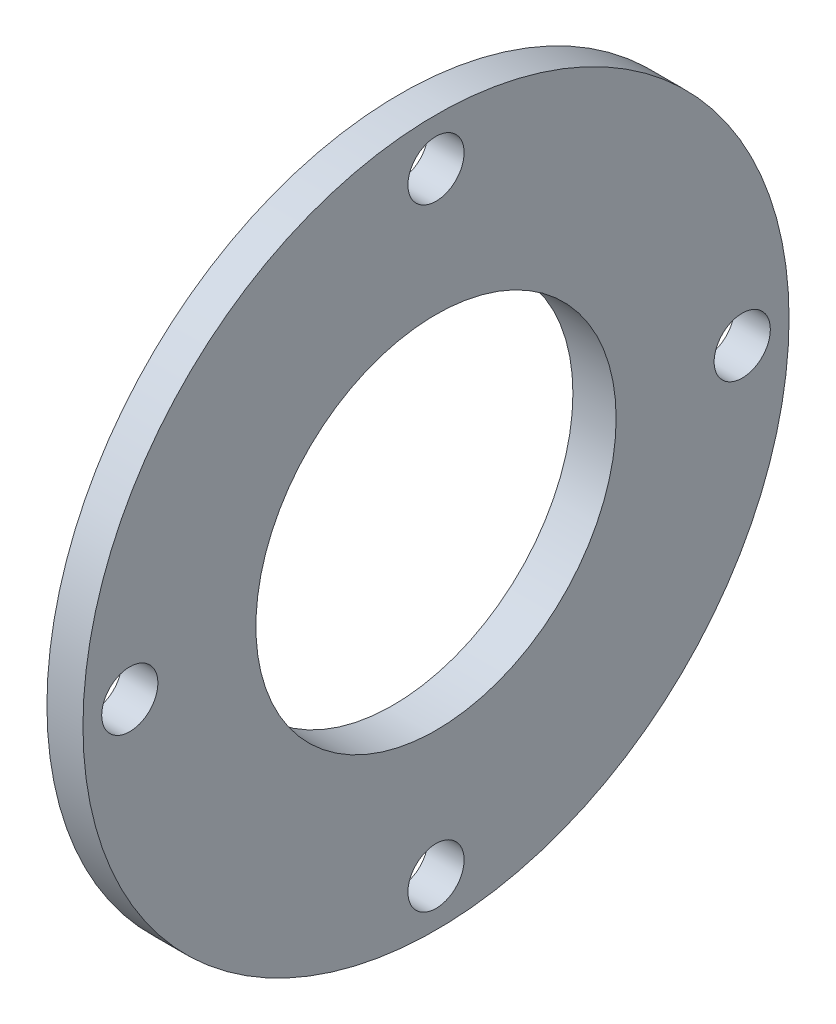
ISO-10303-21;
HEADER;
FILE_DESCRIPTION(('STEP AP214'),'2;1');
FILE_NAME('part.step','',(''),(''),'','','');
FILE_SCHEMA(('AUTOMOTIVE_DESIGN { 1 0 10303 214 1 1 1 1 }'));
ENDSEC;
DATA;
#1=APPLICATION_CONTEXT('core data for automotive mechanical design processes');
#2=APPLICATION_PROTOCOL_DEFINITION('international standard','automotive_design',2000,#1);
#3=PRODUCT_CONTEXT('',#1,'mechanical');
#4=PRODUCT('Part','Part','',(#3));
#5=PRODUCT_RELATED_PRODUCT_CATEGORY('part','',(#4));
#6=PRODUCT_DEFINITION_FORMATION('','',#4);
#7=PRODUCT_DEFINITION_CONTEXT('part definition',#1,'design');
#8=PRODUCT_DEFINITION('design','',#6,#7);
#9=PRODUCT_DEFINITION_SHAPE('','',#8);
#10=(LENGTH_UNIT() NAMED_UNIT(*) SI_UNIT(.MILLI.,.METRE.));
#11=(NAMED_UNIT(*) PLANE_ANGLE_UNIT() SI_UNIT($,.RADIAN.));
#12=(NAMED_UNIT(*) SI_UNIT($,.STERADIAN.) SOLID_ANGLE_UNIT());
#13=UNCERTAINTY_MEASURE_WITH_UNIT(LENGTH_MEASURE(1.E-05),#10,'distance_accuracy_value','');
#14=(GEOMETRIC_REPRESENTATION_CONTEXT(3) GLOBAL_UNCERTAINTY_ASSIGNED_CONTEXT((#13)) GLOBAL_UNIT_ASSIGNED_CONTEXT((#10,
#11,#12)) REPRESENTATION_CONTEXT('',''));
#15=CARTESIAN_POINT('',(0.,0.,0.));
#16=DIRECTION('',(0.,0.,1.));
#17=DIRECTION('',(1.,0.,0.));
#18=AXIS2_PLACEMENT_3D('',#15,#16,#17);
#19=CARTESIAN_POINT('',(0.,0.,0.));
#20=DIRECTION('',(1.,0.,0.));
#21=DIRECTION('',(0.,0.,-1.));
#22=AXIS2_PLACEMENT_3D('',#19,#20,#21);
#23=CYLINDRICAL_SURFACE('',#22,31.);
#24=CARTESIAN_POINT('',(2.,0.,0.));
#25=DIRECTION('',(1.,0.,0.));
#26=DIRECTION('',(0.,0.,-1.));
#27=AXIS2_PLACEMENT_3D('',#24,#25,#26);
#28=CIRCLE('',#27,31.);
#29=CARTESIAN_POINT('',(2.,0.,-31.));
#30=VERTEX_POINT('',#29);
#31=EDGE_CURVE('E50',#30,#30,#28,.T.);
#32=ORIENTED_EDGE('',*,*,#31,.T.);
#33=EDGE_LOOP('',(#32));
#34=FACE_BOUND('',#33,.T.);
#35=CARTESIAN_POINT('',(0.,0.,0.));
#36=DIRECTION('',(1.,0.,0.));
#37=DIRECTION('',(0.,0.,-1.));
#38=AXIS2_PLACEMENT_3D('',#35,#36,#37);
#39=CIRCLE('',#38,31.);
#40=CARTESIAN_POINT('',(0.,0.,-31.));
#41=VERTEX_POINT('',#40);
#42=EDGE_CURVE('E10',#41,#41,#39,.T.);
#43=ORIENTED_EDGE('',*,*,#42,.F.);
#44=EDGE_LOOP('',(#43));
#45=FACE_BOUND('',#44,.T.);
#46=ADVANCED_FACE('F31',(#34,#45),#23,.F.);
#47=CARTESIAN_POINT('',(0.,31.,0.));
#48=DIRECTION('',(-1.,0.,0.));
#49=DIRECTION('',(0.,0.,1.));
#50=AXIS2_PLACEMENT_3D('',#47,#48,#49);
#51=PLANE('',#50);
#52=ORIENTED_EDGE('',*,*,#42,.T.);
#53=EDGE_LOOP('',(#52));
#54=FACE_BOUND('',#53,.T.);
#55=CARTESIAN_POINT('',(0.,0.,0.));
#56=DIRECTION('',(1.,0.,0.));
#57=DIRECTION('',(0.,0.,-1.));
#58=AXIS2_PLACEMENT_3D('',#55,#56,#57);
#59=CIRCLE('',#58,36.);
#60=CARTESIAN_POINT('',(0.,0.,-36.));
#61=VERTEX_POINT('',#60);
#62=EDGE_CURVE('E38',#61,#61,#59,.T.);
#63=ORIENTED_EDGE('',*,*,#62,.F.);
#64=EDGE_LOOP('',(#63));
#65=FACE_BOUND('',#64,.T.);
#66=ADVANCED_FACE('F91',(#54,#65),#51,.T.);
#67=CARTESIAN_POINT('',(0.,0.,0.));
#68=DIRECTION('',(1.,0.,0.));
#69=DIRECTION('',(0.,0.,-1.));
#70=AXIS2_PLACEMENT_3D('',#67,#68,#69);
#71=CYLINDRICAL_SURFACE('',#70,36.);
#72=ORIENTED_EDGE('',*,*,#62,.T.);
#73=EDGE_LOOP('',(#72));
#74=FACE_BOUND('',#73,.T.);
#75=CARTESIAN_POINT('',(2.99999999999999,0.,0.));
#76=DIRECTION('',(1.,0.,0.));
#77=DIRECTION('',(0.,0.,-1.));
#78=AXIS2_PLACEMENT_3D('',#75,#76,#77);
#79=CIRCLE('',#78,36.);
#80=CARTESIAN_POINT('',(2.99999999999999,0.,-36.));
#81=VERTEX_POINT('',#80);
#82=EDGE_CURVE('E43',#81,#81,#79,.T.);
#83=ORIENTED_EDGE('',*,*,#82,.F.);
#84=EDGE_LOOP('',(#83));
#85=FACE_BOUND('',#84,.T.);
#86=ADVANCED_FACE('F89',(#74,#85),#71,.T.);
#87=CARTESIAN_POINT('',(2.99999999999999,36.,0.));
#88=DIRECTION('',(-1.,0.,0.));
#89=DIRECTION('',(0.,0.,1.));
#90=AXIS2_PLACEMENT_3D('',#87,#88,#89);
#91=PLANE('',#90);
#92=CARTESIAN_POINT('',(2.99999999999999,42.5,-1.48387956900833E-13));
#93=DIRECTION('',(-1.,0.,0.));
#94=DIRECTION('',(0.,1.,0.));
#95=AXIS2_PLACEMENT_3D('',#92,#93,#94);
#96=CIRCLE('',#95,3.9);
#97=CARTESIAN_POINT('',(2.99999999999999,46.4,-1.62004734122321E-13));
#98=VERTEX_POINT('',#97);
#99=EDGE_CURVE('E55',#98,#98,#96,.T.);
#100=ORIENTED_EDGE('',*,*,#99,.F.);
#101=EDGE_LOOP('',(#100));
#102=FACE_BOUND('',#101,.T.);
#103=CARTESIAN_POINT('',(2.99999999999999,0.,-42.5));
#104=DIRECTION('',(-1.,0.,0.));
#105=DIRECTION('',(0.,0.,-1.));
#106=AXIS2_PLACEMENT_3D('',#103,#104,#105);
#107=CIRCLE('',#106,3.9);
#108=CARTESIAN_POINT('',(2.99999999999999,0.,-46.4));
#109=VERTEX_POINT('',#108);
#110=EDGE_CURVE('E216',#109,#109,#107,.T.);
#111=ORIENTED_EDGE('',*,*,#110,.F.);
#112=EDGE_LOOP('',(#111));
#113=FACE_BOUND('',#112,.T.);
#114=CARTESIAN_POINT('',(2.99999999999999,-42.5,4.451638707025E-13));
#115=DIRECTION('',(-1.,0.,0.));
#116=DIRECTION('',(0.,-1.,0.));
#117=AXIS2_PLACEMENT_3D('',#114,#115,#116);
#118=CIRCLE('',#117,3.9);
#119=CARTESIAN_POINT('',(2.99999999999999,-46.4,4.86014202366964E-13));
#120=VERTEX_POINT('',#119);
#121=EDGE_CURVE('E68',#120,#120,#118,.T.);
#122=ORIENTED_EDGE('',*,*,#121,.F.);
#123=EDGE_LOOP('',(#122));
#124=FACE_BOUND('',#123,.T.);
#125=CARTESIAN_POINT('',(2.99999999999999,0.,42.5));
#126=DIRECTION('',(-1.,0.,0.));
#127=DIRECTION('',(0.,0.,1.));
#128=AXIS2_PLACEMENT_3D('',#125,#126,#127);
#129=CIRCLE('',#128,3.9);
#130=CARTESIAN_POINT('',(2.99999999999999,0.,46.4));
#131=VERTEX_POINT('',#130);
#132=EDGE_CURVE('E51',#131,#131,#129,.T.);
#133=ORIENTED_EDGE('',*,*,#132,.F.);
#134=EDGE_LOOP('',(#133));
#135=FACE_BOUND('',#134,.T.);
#136=ORIENTED_EDGE('',*,*,#82,.T.);
#137=EDGE_LOOP('',(#136));
#138=FACE_BOUND('',#137,.T.);
#139=CARTESIAN_POINT('',(2.99999999999999,0.,0.));
#140=DIRECTION('',(1.,0.,0.));
#141=DIRECTION('',(0.,0.,-1.));
#142=AXIS2_PLACEMENT_3D('',#139,#140,#141);
#143=CIRCLE('',#142,49.);
#144=CARTESIAN_POINT('',(2.99999999999999,0.,-49.));
#145=VERTEX_POINT('',#144);
#146=EDGE_CURVE('E81',#145,#145,#143,.T.);
#147=ORIENTED_EDGE('',*,*,#146,.F.);
#148=EDGE_LOOP('',(#147));
#149=FACE_BOUND('',#148,.T.);
#150=ADVANCED_FACE('F86',(#102,#113,#124,#135,#138,#149),#91,.T.);
#151=CARTESIAN_POINT('',(0.,0.,0.));
#152=DIRECTION('',(1.,0.,0.));
#153=DIRECTION('',(0.,0.,-1.));
#154=AXIS2_PLACEMENT_3D('',#151,#152,#153);
#155=CYLINDRICAL_SURFACE('',#154,49.);
#156=ORIENTED_EDGE('',*,*,#146,.T.);
#157=EDGE_LOOP('',(#156));
#158=FACE_BOUND('',#157,.T.);
#159=CARTESIAN_POINT('',(8.,0.,0.));
#160=DIRECTION('',(1.,0.,0.));
#161=DIRECTION('',(0.,0.,-1.));
#162=AXIS2_PLACEMENT_3D('',#159,#160,#161);
#163=CIRCLE('',#162,49.);
#164=CARTESIAN_POINT('',(8.,0.,-49.));
#165=VERTEX_POINT('',#164);
#166=EDGE_CURVE('E78',#165,#165,#163,.T.);
#167=ORIENTED_EDGE('',*,*,#166,.F.);
#168=EDGE_LOOP('',(#167));
#169=FACE_BOUND('',#168,.T.);
#170=ADVANCED_FACE('F98',(#158,#169),#155,.T.);
#171=CARTESIAN_POINT('',(8.,49.,0.));
#172=DIRECTION('',(1.,0.,0.));
#173=DIRECTION('',(0.,0.,-1.));
#174=AXIS2_PLACEMENT_3D('',#171,#172,#173);
#175=PLANE('',#174);
#176=CARTESIAN_POINT('',(8.,42.5,-1.48387956900833E-13));
#177=DIRECTION('',(1.,0.,0.));
#178=DIRECTION('',(0.,0.,-1.));
#179=AXIS2_PLACEMENT_3D('',#176,#177,#178);
#180=CIRCLE('',#179,3.9);
#181=CARTESIAN_POINT('',(8.,42.5,-3.90000000000015));
#182=VERTEX_POINT('',#181);
#183=EDGE_CURVE('E34',#182,#182,#180,.T.);
#184=ORIENTED_EDGE('',*,*,#183,.F.);
#185=EDGE_LOOP('',(#184));
#186=FACE_BOUND('',#185,.T.);
#187=CARTESIAN_POINT('',(8.,0.,-42.5));
#188=DIRECTION('',(1.,0.,0.));
#189=DIRECTION('',(0.,0.,-1.));
#190=AXIS2_PLACEMENT_3D('',#187,#188,#189);
#191=CIRCLE('',#190,3.9);
#192=CARTESIAN_POINT('',(8.,0.,-46.4));
#193=VERTEX_POINT('',#192);
#194=EDGE_CURVE('E54',#193,#193,#191,.T.);
#195=ORIENTED_EDGE('',*,*,#194,.F.);
#196=EDGE_LOOP('',(#195));
#197=FACE_BOUND('',#196,.T.);
#198=CARTESIAN_POINT('',(8.,-42.5,4.451638707025E-13));
#199=DIRECTION('',(1.,0.,0.));
#200=DIRECTION('',(0.,0.,-1.));
#201=AXIS2_PLACEMENT_3D('',#198,#199,#200);
#202=CIRCLE('',#201,3.9);
#203=CARTESIAN_POINT('',(8.,-42.5,-3.89999999999955));
#204=VERTEX_POINT('',#203);
#205=EDGE_CURVE('E52',#204,#204,#202,.T.);
#206=ORIENTED_EDGE('',*,*,#205,.F.);
#207=EDGE_LOOP('',(#206));
#208=FACE_BOUND('',#207,.T.);
#209=CARTESIAN_POINT('',(8.,0.,42.5));
#210=DIRECTION('',(1.,0.,0.));
#211=DIRECTION('',(0.,0.,-1.));
#212=AXIS2_PLACEMENT_3D('',#209,#210,#211);
#213=CIRCLE('',#212,3.9);
#214=CARTESIAN_POINT('',(8.,0.,38.6));
#215=VERTEX_POINT('',#214);
#216=EDGE_CURVE('E47',#215,#215,#213,.T.);
#217=ORIENTED_EDGE('',*,*,#216,.F.);
#218=EDGE_LOOP('',(#217));
#219=FACE_BOUND('',#218,.T.);
#220=ORIENTED_EDGE('',*,*,#166,.T.);
#221=EDGE_LOOP('',(#220));
#222=FACE_BOUND('',#221,.T.);
#223=CARTESIAN_POINT('',(8.,0.,0.));
#224=DIRECTION('',(1.,0.,0.));
#225=DIRECTION('',(0.,0.,-1.));
#226=AXIS2_PLACEMENT_3D('',#223,#224,#225);
#227=CIRCLE('',#226,25.);
#228=CARTESIAN_POINT('',(8.,0.,-25.));
#229=VERTEX_POINT('',#228);
#230=EDGE_CURVE('E75',#229,#229,#227,.T.);
#231=ORIENTED_EDGE('',*,*,#230,.F.);
#232=EDGE_LOOP('',(#231));
#233=FACE_BOUND('',#232,.T.);
#234=ADVANCED_FACE('F121',(#186,#197,#208,#219,#222,#233),#175,.T.);
#235=CARTESIAN_POINT('',(0.,0.,0.));
#236=DIRECTION('',(1.,0.,0.));
#237=DIRECTION('',(0.,0.,-1.));
#238=AXIS2_PLACEMENT_3D('',#235,#236,#237);
#239=CYLINDRICAL_SURFACE('',#238,25.);
#240=ORIENTED_EDGE('',*,*,#230,.T.);
#241=EDGE_LOOP('',(#240));
#242=FACE_BOUND('',#241,.T.);
#243=CARTESIAN_POINT('',(2.,0.,0.));
#244=DIRECTION('',(1.,0.,0.));
#245=DIRECTION('',(0.,0.,-1.));
#246=AXIS2_PLACEMENT_3D('',#243,#244,#245);
#247=CIRCLE('',#246,25.);
#248=CARTESIAN_POINT('',(2.,0.,-25.));
#249=VERTEX_POINT('',#248);
#250=EDGE_CURVE('E72',#249,#249,#247,.T.);
#251=ORIENTED_EDGE('',*,*,#250,.F.);
#252=EDGE_LOOP('',(#251));
#253=FACE_BOUND('',#252,.T.);
#254=ADVANCED_FACE('F111',(#242,#253),#239,.F.);
#255=CARTESIAN_POINT('',(2.,25.,0.));
#256=DIRECTION('',(-1.,0.,0.));
#257=DIRECTION('',(0.,0.,1.));
#258=AXIS2_PLACEMENT_3D('',#255,#256,#257);
#259=PLANE('',#258);
#260=ORIENTED_EDGE('',*,*,#250,.T.);
#261=EDGE_LOOP('',(#260));
#262=FACE_BOUND('',#261,.T.);
#263=ORIENTED_EDGE('',*,*,#31,.F.);
#264=EDGE_LOOP('',(#263));
#265=FACE_BOUND('',#264,.T.);
#266=ADVANCED_FACE('F108',(#262,#265),#259,.T.);
#267=CARTESIAN_POINT('',(13.,0.,42.5));
#268=DIRECTION('',(-1.,0.,0.));
#269=DIRECTION('',(0.,0.,1.));
#270=AXIS2_PLACEMENT_3D('',#267,#268,#269);
#271=CYLINDRICAL_SURFACE('',#270,3.9);
#272=ORIENTED_EDGE('',*,*,#216,.T.);
#273=EDGE_LOOP('',(#272));
#274=FACE_BOUND('',#273,.T.);
#275=ORIENTED_EDGE('',*,*,#132,.T.);
#276=EDGE_LOOP('',(#275));
#277=FACE_BOUND('',#276,.T.);
#278=ADVANCED_FACE('F110',(#274,#277),#271,.F.);
#279=CARTESIAN_POINT('',(13.,-42.5,4.451638707025E-13));
#280=DIRECTION('',(-1.,0.,0.));
#281=DIRECTION('',(0.,0.,1.));
#282=AXIS2_PLACEMENT_3D('',#279,#280,#281);
#283=CYLINDRICAL_SURFACE('',#282,3.9);
#284=ORIENTED_EDGE('',*,*,#205,.T.);
#285=EDGE_LOOP('',(#284));
#286=FACE_BOUND('',#285,.T.);
#287=ORIENTED_EDGE('',*,*,#121,.T.);
#288=EDGE_LOOP('',(#287));
#289=FACE_BOUND('',#288,.T.);
#290=ADVANCED_FACE('F118',(#286,#289),#283,.F.);
#291=CARTESIAN_POINT('',(13.,0.,-42.5));
#292=DIRECTION('',(-1.,0.,0.));
#293=DIRECTION('',(0.,0.,1.));
#294=AXIS2_PLACEMENT_3D('',#291,#292,#293);
#295=CYLINDRICAL_SURFACE('',#294,3.9);
#296=ORIENTED_EDGE('',*,*,#194,.T.);
#297=EDGE_LOOP('',(#296));
#298=FACE_BOUND('',#297,.T.);
#299=ORIENTED_EDGE('',*,*,#110,.T.);
#300=EDGE_LOOP('',(#299));
#301=FACE_BOUND('',#300,.T.);
#302=ADVANCED_FACE('F192',(#298,#301),#295,.F.);
#303=CARTESIAN_POINT('',(13.,42.5,-1.48387956900833E-13));
#304=DIRECTION('',(-1.,0.,0.));
#305=DIRECTION('',(0.,0.,1.));
#306=AXIS2_PLACEMENT_3D('',#303,#304,#305);
#307=CYLINDRICAL_SURFACE('',#306,3.9);
#308=ORIENTED_EDGE('',*,*,#183,.T.);
#309=EDGE_LOOP('',(#308));
#310=FACE_BOUND('',#309,.T.);
#311=ORIENTED_EDGE('',*,*,#99,.T.);
#312=EDGE_LOOP('',(#311));
#313=FACE_BOUND('',#312,.T.);
#314=ADVANCED_FACE('F198',(#310,#313),#307,.F.);
#315=CLOSED_SHELL('',(#46,#66,#86,#150,#170,#234,#254,#266,#278,#290,#302,#314));
#316=MANIFOLD_SOLID_BREP('B2',#315);
#317=ADVANCED_BREP_SHAPE_REPRESENTATION('',(#18,#316),#14);
#318=SHAPE_DEFINITION_REPRESENTATION(#9,#317);
ENDSEC;
END-ISO-10303-21;
